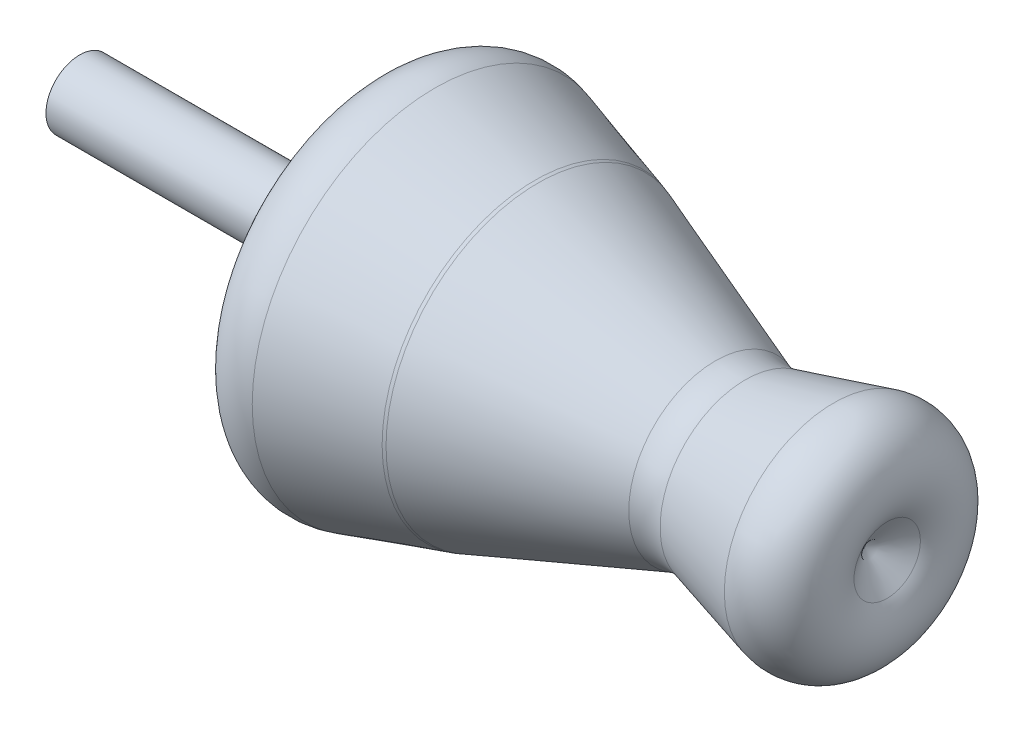
ISO-10303-21;
HEADER;
FILE_DESCRIPTION(('STEP AP214'),'2;1');
FILE_NAME('part.step','',(''),(''),'','','');
FILE_SCHEMA(('AUTOMOTIVE_DESIGN { 1 0 10303 214 1 1 1 1 }'));
ENDSEC;
DATA;
#1=APPLICATION_CONTEXT('core data for automotive mechanical design processes');
#2=APPLICATION_PROTOCOL_DEFINITION('international standard','automotive_design',2000,#1);
#3=PRODUCT_CONTEXT('',#1,'mechanical');
#4=PRODUCT('Part','Part','',(#3));
#5=PRODUCT_RELATED_PRODUCT_CATEGORY('part','',(#4));
#6=PRODUCT_DEFINITION_FORMATION('','',#4);
#7=PRODUCT_DEFINITION_CONTEXT('part definition',#1,'design');
#8=PRODUCT_DEFINITION('design','',#6,#7);
#9=PRODUCT_DEFINITION_SHAPE('','',#8);
#10=(LENGTH_UNIT() NAMED_UNIT(*) SI_UNIT(.MILLI.,.METRE.));
#11=(NAMED_UNIT(*) PLANE_ANGLE_UNIT() SI_UNIT($,.RADIAN.));
#12=(NAMED_UNIT(*) SI_UNIT($,.STERADIAN.) SOLID_ANGLE_UNIT());
#13=UNCERTAINTY_MEASURE_WITH_UNIT(LENGTH_MEASURE(1.E-05),#10,'distance_accuracy_value','');
#14=(GEOMETRIC_REPRESENTATION_CONTEXT(3) GLOBAL_UNCERTAINTY_ASSIGNED_CONTEXT((#13)) GLOBAL_UNIT_ASSIGNED_CONTEXT((#10,
#11,#12)) REPRESENTATION_CONTEXT('',''));
#15=CARTESIAN_POINT('',(0.,0.,0.));
#16=DIRECTION('',(0.,0.,1.));
#17=DIRECTION('',(1.,0.,0.));
#18=AXIS2_PLACEMENT_3D('',#15,#16,#17);
#19=CARTESIAN_POINT('',(-114.309777555519,6.80871997184716,0.));
#20=DIRECTION('',(-1.,0.,0.));
#21=DIRECTION('',(0.,0.,1.));
#22=AXIS2_PLACEMENT_3D('',#19,#20,#21);
#23=PLANE('',#22);
#24=CARTESIAN_POINT('',(-114.309777555519,0.,0.));
#25=DIRECTION('',(1.,0.,0.));
#26=DIRECTION('',(0.,0.,-1.));
#27=AXIS2_PLACEMENT_3D('',#24,#25,#26);
#28=CIRCLE('',#27,6.80871997184716);
#29=CARTESIAN_POINT('',(-114.309777555519,0.,-6.80871997184716));
#30=VERTEX_POINT('',#29);
#31=EDGE_CURVE('E127',#30,#30,#28,.T.);
#32=ORIENTED_EDGE('',*,*,#31,.F.);
#33=EDGE_LOOP('',(#32));
#34=FACE_BOUND('',#33,.T.);
#35=ADVANCED_FACE('F39',(#34),#23,.T.);
#36=CARTESIAN_POINT('',(44.1128336204182,0.,0.));
#37=DIRECTION('',(1.,0.,0.));
#38=DIRECTION('',(0.,0.,-1.));
#39=AXIS2_PLACEMENT_3D('',#36,#37,#38);
#40=CONICAL_SURFACE('',#39,0.,0.963378687345011);
#41=CARTESIAN_POINT('',(48.7708161512065,0.,0.));
#42=DIRECTION('',(-1.,0.,0.));
#43=DIRECTION('',(0.,0.,1.));
#44=AXIS2_PLACEMENT_3D('',#41,#42,#43);
#45=CIRCLE('',#44,6.70134279193595);
#46=CARTESIAN_POINT('',(48.7708161512065,0.,6.70134279193595));
#47=VERTEX_POINT('',#46);
#48=EDGE_CURVE('E136',#47,#47,#45,.F.);
#49=ORIENTED_EDGE('',*,*,#48,.T.);
#50=EDGE_LOOP('',(#49));
#51=FACE_BOUND('',#50,.T.);
#52=CARTESIAN_POINT('',(44.1128336204182,0.,0.));
#53=VERTEX_POINT('',#52);
#54=VERTEX_LOOP('',#53);
#55=FACE_BOUND('',#54,.T.);
#56=ADVANCED_FACE('F49',(#51,#55),#40,.F.);
#57=CARTESIAN_POINT('',(64.4430960715675,0.,0.));
#58=DIRECTION('',(1.,0.,0.));
#59=DIRECTION('',(0.,0.,-1.));
#60=AXIS2_PLACEMENT_3D('',#57,#58,#59);
#61=CONICAL_SURFACE('',#60,29.2487266396251,0.264881248090425);
#62=CARTESIAN_POINT('',(37.9416232180942,0.,0.));
#63=DIRECTION('',(-1.,0.,0.));
#64=DIRECTION('',(0.,0.,1.));
#65=AXIS2_PLACEMENT_3D('',#62,#63,#64);
#66=CIRCLE('',#65,22.060068011355);
#67=CARTESIAN_POINT('',(37.9416232180942,0.,22.060068011355));
#68=VERTEX_POINT('',#67);
#69=EDGE_CURVE('E93',#68,#68,#66,.T.);
#70=ORIENTED_EDGE('',*,*,#69,.T.);
#71=EDGE_LOOP('',(#70));
#72=FACE_BOUND('',#71,.T.);
#73=CARTESIAN_POINT('',(20.1463601973238,0.,0.));
#74=DIRECTION('',(1.,0.,0.));
#75=DIRECTION('',(0.,0.,-1.));
#76=AXIS2_PLACEMENT_3D('',#73,#74,#75);
#77=CIRCLE('',#76,17.233012859972);
#78=CARTESIAN_POINT('',(20.1463601973238,0.,-17.233012859972));
#79=VERTEX_POINT('',#78);
#80=EDGE_CURVE('E98',#79,#79,#77,.T.);
#81=ORIENTED_EDGE('',*,*,#80,.T.);
#82=EDGE_LOOP('',(#81));
#83=FACE_BOUND('',#82,.T.);
#84=ADVANCED_FACE('F51',(#72,#83),#61,.T.);
#85=CARTESIAN_POINT('',(17.069748661814,0.,0.));
#86=DIRECTION('',(-1.,0.,0.));
#87=DIRECTION('',(0.,0.,1.));
#88=AXIS2_PLACEMENT_3D('',#85,#86,#87);
#89=CONICAL_SURFACE('',#88,16.3984664110685,0.352308724674142);
#90=CARTESIAN_POINT('',(-21.7627228220086,0.,0.));
#91=DIRECTION('',(1.,0.,0.));
#92=DIRECTION('',(0.,0.,-1.));
#93=AXIS2_PLACEMENT_3D('',#90,#91,#92);
#94=CIRCLE('',#93,30.6751103389445);
#95=CARTESIAN_POINT('',(-21.7627228220086,0.,-30.6751103389445));
#96=VERTEX_POINT('',#95);
#97=EDGE_CURVE('E123',#96,#96,#94,.T.);
#98=ORIENTED_EDGE('',*,*,#97,.T.);
#99=EDGE_LOOP('',(#98));
#100=FACE_BOUND('',#99,.T.);
#101=CARTESIAN_POINT('',(14.0777571537573,0.,0.));
#102=DIRECTION('',(-1.,0.,0.));
#103=DIRECTION('',(0.,0.,1.));
#104=AXIS2_PLACEMENT_3D('',#101,#102,#103);
#105=CIRCLE('',#104,17.4984632890305);
#106=CARTESIAN_POINT('',(14.0777571537573,0.,17.4984632890305));
#107=VERTEX_POINT('',#106);
#108=EDGE_CURVE('E126',#107,#107,#105,.T.);
#109=ORIENTED_EDGE('',*,*,#108,.T.);
#110=EDGE_LOOP('',(#109));
#111=FACE_BOUND('',#110,.T.);
#112=ADVANCED_FACE('F58',(#100,#111),#89,.T.);
#113=CARTESIAN_POINT('',(-22.0564168102091,0.,0.));
#114=DIRECTION('',(-1.,0.,0.));
#115=DIRECTION('',(0.,0.,1.));
#116=AXIS2_PLACEMENT_3D('',#113,#114,#115);
#117=CONICAL_SURFACE('',#116,30.7830860699005,0.289746419862919);
#118=CARTESIAN_POINT('',(-42.5631076146639,0.,0.));
#119=DIRECTION('',(1.,0.,0.));
#120=DIRECTION('',(0.,0.,-1.));
#121=AXIS2_PLACEMENT_3D('',#118,#119,#120);
#122=CIRCLE('',#121,36.8968820861355);
#123=CARTESIAN_POINT('',(-42.5631076146639,0.,-36.8968820861355));
#124=VERTEX_POINT('',#123);
#125=EDGE_CURVE('E90',#124,#124,#122,.T.);
#126=ORIENTED_EDGE('',*,*,#125,.T.);
#127=EDGE_LOOP('',(#126));
#128=FACE_BOUND('',#127,.T.);
#129=CARTESIAN_POINT('',(-22.3562870253148,0.,0.));
#130=DIRECTION('',(1.,0.,0.));
#131=DIRECTION('',(0.,0.,-1.));
#132=AXIS2_PLACEMENT_3D('',#129,#130,#131);
#133=CIRCLE('',#132,30.8724883700563);
#134=CARTESIAN_POINT('',(-22.3562870253148,0.,-30.8724883700563));
#135=VERTEX_POINT('',#134);
#136=EDGE_CURVE('E129',#135,#135,#133,.F.);
#137=ORIENTED_EDGE('',*,*,#136,.T.);
#138=EDGE_LOOP('',(#137));
#139=FACE_BOUND('',#138,.T.);
#140=ADVANCED_FACE('F105',(#128,#139),#117,.T.);
#141=CARTESIAN_POINT('',(-52.9354003445019,0.,0.));
#142=DIRECTION('',(1.,0.,0.));
#143=DIRECTION('',(0.,0.,-1.));
#144=AXIS2_PLACEMENT_3D('',#141,#142,#143);
#145=CONICAL_SURFACE('',#144,39.989242651553,1.36009778233964);
#146=CARTESIAN_POINT('',(-55.1990504337345,0.,0.));
#147=DIRECTION('',(-1.,0.,0.));
#148=DIRECTION('',(0.,0.,1.));
#149=AXIS2_PLACEMENT_3D('',#146,#147,#148);
#150=CIRCLE('',#149,29.405148991087);
#151=CARTESIAN_POINT('',(-55.1990504337345,0.,29.405148991087));
#152=VERTEX_POINT('',#151);
#153=EDGE_CURVE('E46',#152,#152,#150,.T.);
#154=ORIENTED_EDGE('',*,*,#153,.T.);
#155=EDGE_LOOP('',(#154));
#156=FACE_BOUND('',#155,.T.);
#157=CARTESIAN_POINT('',(-58.3403845441555,0.,0.));
#158=DIRECTION('',(1.,0.,0.));
#159=DIRECTION('',(0.,0.,-1.));
#160=AXIS2_PLACEMENT_3D('',#157,#158,#159);
#161=CIRCLE('',#160,14.7172895018213);
#162=CARTESIAN_POINT('',(-58.3403845441555,0.,-14.7172895018213));
#163=VERTEX_POINT('',#162);
#164=EDGE_CURVE('E92',#163,#163,#161,.T.);
#165=ORIENTED_EDGE('',*,*,#164,.T.);
#166=EDGE_LOOP('',(#165));
#167=FACE_BOUND('',#166,.T.);
#168=ADVANCED_FACE('F102',(#156,#167),#145,.T.);
#169=CARTESIAN_POINT('',(44.1128336204182,0.,0.));
#170=DIRECTION('',(1.,0.,0.));
#171=DIRECTION('',(0.,0.,-1.));
#172=AXIS2_PLACEMENT_3D('',#169,#170,#171);
#173=CYLINDRICAL_SURFACE('',#172,6.80871997184716);
#174=CARTESIAN_POINT('',(-68.1192351202226,0.,0.));
#175=DIRECTION('',(1.,0.,0.));
#176=DIRECTION('',(0.,0.,-1.));
#177=AXIS2_PLACEMENT_3D('',#174,#175,#176);
#178=CIRCLE('',#177,6.80871997184716);
#179=CARTESIAN_POINT('',(-68.1192351202226,0.,-6.80871997184716));
#180=VERTEX_POINT('',#179);
#181=EDGE_CURVE('E11',#180,#180,#178,.F.);
#182=ORIENTED_EDGE('',*,*,#181,.T.);
#183=EDGE_LOOP('',(#182));
#184=FACE_BOUND('',#183,.T.);
#185=ORIENTED_EDGE('',*,*,#31,.T.);
#186=EDGE_LOOP('',(#185));
#187=FACE_BOUND('',#186,.T.);
#188=ADVANCED_FACE('F70',(#184,#187),#173,.T.);
#189=CARTESIAN_POINT('',(-25.2133792683184,0.,0.));
#190=DIRECTION('',(-1.,0.,0.));
#191=DIRECTION('',(0.,0.,1.));
#192=AXIS2_PLACEMENT_3D('',#189,#190,#191);
#193=TOROIDAL_SURFACE('',#192,21.2893248049819,10.);
#194=ORIENTED_EDGE('',*,*,#136,.F.);
#195=EDGE_LOOP('',(#194));
#196=FACE_BOUND('',#195,.T.);
#197=ORIENTED_EDGE('',*,*,#97,.F.);
#198=EDGE_LOOP('',(#197));
#199=FACE_BOUND('',#198,.T.);
#200=ADVANCED_FACE('F66',(#196,#199),#193,.T.);
#201=CARTESIAN_POINT('',(40.5595698153509,0.,0.));
#202=DIRECTION('',(-1.,0.,0.));
#203=DIRECTION('',(0.,0.,1.));
#204=AXIS2_PLACEMENT_3D('',#201,#202,#203);
#205=TOROIDAL_SURFACE('',#204,12.4088320483339,10.);
#206=ORIENTED_EDGE('',*,*,#69,.F.);
#207=EDGE_LOOP('',(#206));
#208=FACE_BOUND('',#207,.T.);
#209=ORIENTED_EDGE('',*,*,#48,.F.);
#210=EDGE_LOOP('',(#209));
#211=FACE_BOUND('',#210,.T.);
#212=ADVANCED_FACE('F69',(#208,#211),#205,.T.);
#213=CARTESIAN_POINT('',(17.5284136000671,0.,0.));
#214=DIRECTION('',(1.,0.,0.));
#215=DIRECTION('',(0.,0.,-1.));
#216=AXIS2_PLACEMENT_3D('',#213,#214,#215);
#217=TOROIDAL_SURFACE('',#216,26.8842488229931,10.);
#218=ORIENTED_EDGE('',*,*,#108,.F.);
#219=EDGE_LOOP('',(#218));
#220=FACE_BOUND('',#219,.T.);
#221=ORIENTED_EDGE('',*,*,#80,.F.);
#222=EDGE_LOOP('',(#221));
#223=FACE_BOUND('',#222,.T.);
#224=ADVANCED_FACE('F74',(#220,#223),#217,.F.);
#225=CARTESIAN_POINT('',(-45.4201998576674,0.,0.));
#226=DIRECTION('',(-1.,0.,0.));
#227=DIRECTION('',(0.,0.,1.));
#228=AXIS2_PLACEMENT_3D('',#225,#226,#227);
#229=TOROIDAL_SURFACE('',#228,27.3137185210611,10.);
#230=ORIENTED_EDGE('',*,*,#153,.F.);
#231=EDGE_LOOP('',(#230));
#232=FACE_BOUND('',#231,.T.);
#233=ORIENTED_EDGE('',*,*,#125,.F.);
#234=EDGE_LOOP('',(#233));
#235=FACE_BOUND('',#234,.T.);
#236=ADVANCED_FACE('F77',(#232,#235),#229,.T.);
#237=CARTESIAN_POINT('',(-68.1192351202226,0.,0.));
#238=DIRECTION('',(1.,0.,0.));
#239=DIRECTION('',(0.,0.,-1.));
#240=AXIS2_PLACEMENT_3D('',#237,#238,#239);
#241=TOROIDAL_SURFACE('',#240,16.8087199718472,10.);
#242=ORIENTED_EDGE('',*,*,#181,.F.);
#243=EDGE_LOOP('',(#242));
#244=FACE_BOUND('',#243,.T.);
#245=ORIENTED_EDGE('',*,*,#164,.F.);
#246=EDGE_LOOP('',(#245));
#247=FACE_BOUND('',#246,.T.);
#248=ADVANCED_FACE('F41',(#244,#247),#241,.F.);
#249=CLOSED_SHELL('',(#35,#56,#84,#112,#140,#168,#188,#200,#212,#224,#236,#248));
#250=MANIFOLD_SOLID_BREP('B2',#249);
#251=ADVANCED_BREP_SHAPE_REPRESENTATION('',(#18,#250),#14);
#252=SHAPE_DEFINITION_REPRESENTATION(#9,#251);
ENDSEC;
END-ISO-10303-21;
